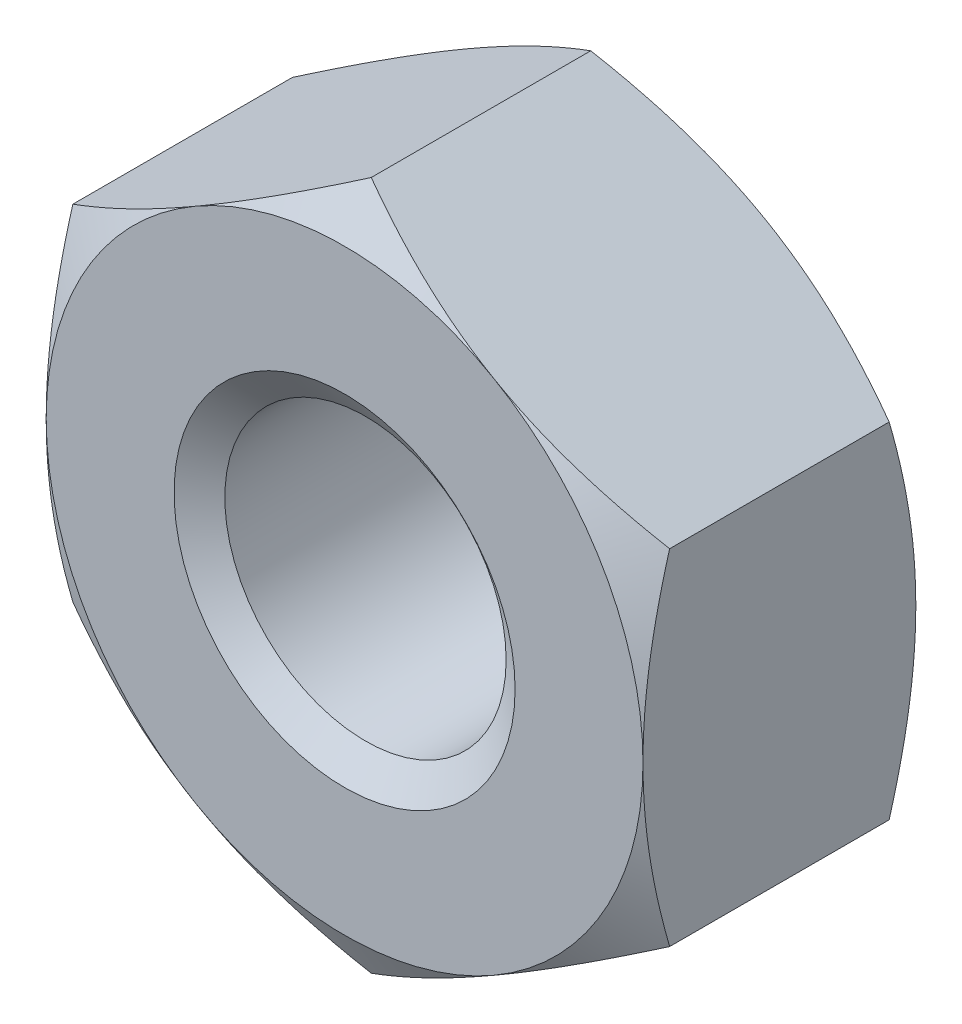
ISO-10303-21;
HEADER;
FILE_DESCRIPTION(('STEP AP214'),'2;1');
FILE_NAME('part.step','',(''),(''),'','','');
FILE_SCHEMA(('AUTOMOTIVE_DESIGN { 1 0 10303 214 1 1 1 1 }'));
ENDSEC;
DATA;
#1=APPLICATION_CONTEXT('core data for automotive mechanical design processes');
#2=APPLICATION_PROTOCOL_DEFINITION('international standard','automotive_design',2000,#1);
#3=PRODUCT_CONTEXT('',#1,'mechanical');
#4=PRODUCT('Part','Part','',(#3));
#5=PRODUCT_RELATED_PRODUCT_CATEGORY('part','',(#4));
#6=PRODUCT_DEFINITION_FORMATION('','',#4);
#7=PRODUCT_DEFINITION_CONTEXT('part definition',#1,'design');
#8=PRODUCT_DEFINITION('design','',#6,#7);
#9=PRODUCT_DEFINITION_SHAPE('','',#8);
#10=(LENGTH_UNIT() NAMED_UNIT(*) SI_UNIT(.MILLI.,.METRE.));
#11=(NAMED_UNIT(*) PLANE_ANGLE_UNIT() SI_UNIT($,.RADIAN.));
#12=(NAMED_UNIT(*) SI_UNIT($,.STERADIAN.) SOLID_ANGLE_UNIT());
#13=UNCERTAINTY_MEASURE_WITH_UNIT(LENGTH_MEASURE(1.E-05),#10,'distance_accuracy_value','');
#14=(GEOMETRIC_REPRESENTATION_CONTEXT(3) GLOBAL_UNCERTAINTY_ASSIGNED_CONTEXT((#13)) GLOBAL_UNIT_ASSIGNED_CONTEXT((#10,
#11,#12)) REPRESENTATION_CONTEXT('',''));
#15=CARTESIAN_POINT('',(0.,0.,0.));
#16=DIRECTION('',(0.,0.,1.));
#17=DIRECTION('',(1.,0.,0.));
#18=AXIS2_PLACEMENT_3D('',#15,#16,#17);
#19=CARTESIAN_POINT('',(0.,0.,-3.2));
#20=DIRECTION('',(0.,0.,1.));
#21=DIRECTION('',(1.,0.,0.));
#22=AXIS2_PLACEMENT_3D('',#19,#20,#21);
#23=CYLINDRICAL_SURFACE('',#22,1.65);
#24=CARTESIAN_POINT('',(0.,0.,-0.2450726383734));
#25=DIRECTION('',(0.,0.,1.));
#26=DIRECTION('',(1.,0.,0.));
#27=AXIS2_PLACEMENT_3D('',#24,#25,#26);
#28=CIRCLE('',#27,1.65);
#29=CARTESIAN_POINT('',(1.65,0.,-0.2450726383734));
#30=VERTEX_POINT('',#29);
#31=EDGE_CURVE('E178',#30,#30,#28,.F.);
#32=ORIENTED_EDGE('',*,*,#31,.F.);
#33=EDGE_LOOP('',(#32));
#34=FACE_BOUND('',#33,.T.);
#35=CARTESIAN_POINT('',(0.,0.,-2.9295273616266));
#36=DIRECTION('',(0.,0.,-1.));
#37=DIRECTION('',(-1.,0.,0.));
#38=AXIS2_PLACEMENT_3D('',#35,#36,#37);
#39=CIRCLE('',#38,1.65);
#40=CARTESIAN_POINT('',(-1.65,0.,-2.9295273616266));
#41=VERTEX_POINT('',#40);
#42=EDGE_CURVE('E43',#41,#41,#39,.F.);
#43=ORIENTED_EDGE('',*,*,#42,.F.);
#44=EDGE_LOOP('',(#43));
#45=FACE_BOUND('',#44,.T.);
#46=ADVANCED_FACE('F38',(#34,#45),#23,.F.);
#47=CARTESIAN_POINT('',(0.,4.04145188432739,-3.2));
#48=DIRECTION('',(-0.500000000000006,0.866025403784435,0.));
#49=DIRECTION('',(-0.866025403784435,-0.500000000000006,0.));
#50=AXIS2_PLACEMENT_3D('',#47,#48,#49);
#51=PLANE('',#50);
#52=DIRECTION('',(0.,0.,1.));
#53=VECTOR('',#52,1.);
#54=CARTESIAN_POINT('',(-3.5,2.02072594216367,-3.2));
#55=LINE('',#54,#53);
#56=CARTESIAN_POINT('',(-3.5,2.02072594216372,-2.88739260883035));
#57=VERTEX_POINT('',#56);
#58=CARTESIAN_POINT('',(-3.5,2.02072594216367,-0.312607391169638));
#59=VERTEX_POINT('',#58);
#60=EDGE_CURVE('E168',#57,#59,#55,.T.);
#61=ORIENTED_EDGE('',*,*,#60,.T.);
#62=CARTESIAN_POINT('',(-3.5002,2.02061047210983,-0.312674060693366));
#63=CARTESIAN_POINT('',(-3.34639282154755,2.10941108799265,-0.261385788989979));
#64=CARTESIAN_POINT('',(-3.19125798916558,2.19897822522907,-0.214740953816192));
#65=CARTESIAN_POINT('',(-2.87830199342322,2.37966345361543,-0.133321875533345));
#66=CARTESIAN_POINT('',(-2.72047526921251,2.47078475532381,-0.0985764355845578));
#67=CARTESIAN_POINT('',(-2.40677778961988,2.65189807961072,-0.0444900271828332));
#68=CARTESIAN_POINT('',(-2.25095530083932,2.74186223545398,-0.0247890862603791));
#69=CARTESIAN_POINT('',(-1.93857711279464,2.92221386641055,-0.00127013273725249));
#70=CARTESIAN_POINT('',(-1.78202254896578,3.01260068598,0.00256735545443638));
#71=CARTESIAN_POINT('',(-1.48949078007902,3.18149398149329,-0.00541530187697692));
#72=CARTESIAN_POINT('',(-1.3534697875421,3.26002573814992,-0.015275434069607));
#73=CARTESIAN_POINT('',(-1.08231397971101,3.41657761679354,-0.0465264668994047));
#74=CARTESIAN_POINT('',(-0.947180102315324,3.49459719728458,-0.0679280432858));
#75=CARTESIAN_POINT('',(-0.675465207594821,3.65147186489429,-0.12143040788058));
#76=CARTESIAN_POINT('',(-0.538918580721668,3.73030709667644,-0.153757994445091));
#77=CARTESIAN_POINT('',(-0.267861907055501,3.88680174018325,-0.227128933808001));
#78=CARTESIAN_POINT('',(-0.133348387531465,3.9644631568901,-0.268155046569874));
#79=CARTESIAN_POINT('',(0.00019999999999918,4.04156735438123,-0.312674060693379));
#80=B_SPLINE_CURVE_WITH_KNOTS('',3,(#62,#63,#64,#65,#66,#67,#68,#69,#70,#71,#72,#73,#74,#75,#76,
#77,#78,#79),.UNSPECIFIED.,.F.,.F.,(4,2,2,2,2,2,2,2,4),(0.,0.554793832886253,1.11092123814983,
1.65328467083218,2.19498204478403,2.6666513085086,3.13875761298268,3.62133612600511,
4.10296698719189),.UNSPECIFIED.);
#81=CARTESIAN_POINT('',(-1.75000000000002,3.03108891324552,0.));
#82=VERTEX_POINT('',#81);
#83=EDGE_CURVE('E137',#59,#82,#80,.T.);
#84=ORIENTED_EDGE('',*,*,#83,.T.);
#85=CARTESIAN_POINT('',(0.,4.04145188432739,-0.312607391169652));
#86=VERTEX_POINT('',#85);
#87=EDGE_CURVE('E57',#82,#86,#80,.T.);
#88=ORIENTED_EDGE('',*,*,#87,.T.);
#89=DIRECTION('',(0.,0.,1.));
#90=VECTOR('',#89,1.);
#91=CARTESIAN_POINT('',(0.,4.04145188432739,-3.2));
#92=LINE('',#91,#90);
#93=CARTESIAN_POINT('',(0.,4.04145188432739,-2.88739260883035));
#94=VERTEX_POINT('',#93);
#95=EDGE_CURVE('E153',#94,#86,#92,.T.);
#96=ORIENTED_EDGE('',*,*,#95,.F.);
#97=CARTESIAN_POINT('',(-3.5002,2.02061047210983,-2.88732593930664));
#98=CARTESIAN_POINT('',(-3.34639282154755,2.10941108799265,-2.93861421101002));
#99=CARTESIAN_POINT('',(-3.19125798916558,2.19897822522907,-2.98525904618381));
#100=CARTESIAN_POINT('',(-2.87830199342322,2.37966345361543,-3.06667812446666));
#101=CARTESIAN_POINT('',(-2.72047526921251,2.47078475532381,-3.10142356441544));
#102=CARTESIAN_POINT('',(-2.40677778961988,2.65189807961072,-3.15550997281717));
#103=CARTESIAN_POINT('',(-2.25095530083932,2.74186223545398,-3.17521091373962));
#104=CARTESIAN_POINT('',(-1.93857711279464,2.92221386641055,-3.19872986726275));
#105=CARTESIAN_POINT('',(-1.78202254896578,3.01260068598,-3.20256735545444));
#106=CARTESIAN_POINT('',(-1.48949078007902,3.18149398149329,-3.19458469812302));
#107=CARTESIAN_POINT('',(-1.3534697875421,3.26002573814992,-3.18472456593039));
#108=CARTESIAN_POINT('',(-1.08231397971101,3.41657761679354,-3.1534735331006));
#109=CARTESIAN_POINT('',(-0.947180102315324,3.49459719728458,-3.1320719567142));
#110=CARTESIAN_POINT('',(-0.675465207594821,3.65147186489429,-3.07856959211942));
#111=CARTESIAN_POINT('',(-0.538918580721668,3.73030709667644,-3.04624200555491));
#112=CARTESIAN_POINT('',(-0.267861907055501,3.88680174018325,-2.972871066192));
#113=CARTESIAN_POINT('',(-0.133348387531465,3.9644631568901,-2.93184495343013));
#114=CARTESIAN_POINT('',(0.000199999999999185,4.04156735438123,-2.88732593930662));
#115=B_SPLINE_CURVE_WITH_KNOTS('',3,(#97,#98,#99,#100,#101,#102,#103,#104,#105,#106,#107,#108,
#109,#110,#111,#112,#113,#114),.UNSPECIFIED.,.F.,.F.,(4,2,2,2,2,2,2,2,4),(0.,0.554793832886253,
1.11092123814983,1.65328467083218,2.19498204478403,2.6666513085086,3.13875761298268,
3.62133612600511,4.10296698719189),.UNSPECIFIED.);
#116=CARTESIAN_POINT('',(-1.75000000000002,3.03108891324552,-3.2));
#117=VERTEX_POINT('',#116);
#118=EDGE_CURVE('E171',#117,#94,#115,.T.);
#119=ORIENTED_EDGE('',*,*,#118,.F.);
#120=EDGE_CURVE('E270',#57,#117,#115,.T.);
#121=ORIENTED_EDGE('',*,*,#120,.F.);
#122=EDGE_LOOP('',(#61,#84,#88,#96,#119,#121));
#123=FACE_BOUND('',#122,.T.);
#124=ADVANCED_FACE('F40',(#123),#51,.T.);
#125=CARTESIAN_POINT('',(3.5,2.02072594216368,-3.2));
#126=DIRECTION('',(0.500000000000005,0.866025403784436,0.));
#127=DIRECTION('',(-0.866025403784436,0.500000000000005,0.));
#128=AXIS2_PLACEMENT_3D('',#125,#126,#127);
#129=PLANE('',#128);
#130=ORIENTED_EDGE('',*,*,#95,.T.);
#131=CARTESIAN_POINT('',(-0.00020000000000071,4.04156735438123,-0.31267406069338));
#132=CARTESIAN_POINT('',(0.153607178452449,3.95276673849841,-0.261385788989991));
#133=CARTESIAN_POINT('',(0.308742010834423,3.86319960126199,-0.214740953816204));
#134=CARTESIAN_POINT('',(0.62169800657678,3.68251437287563,-0.133321875533354));
#135=CARTESIAN_POINT('',(0.779524730787495,3.59139307116726,-0.0985764355845659));
#136=CARTESIAN_POINT('',(1.09322221038013,3.41027974688034,-0.0444900271828389));
#137=CARTESIAN_POINT('',(1.24904469916069,3.32031559103708,-0.0247890862603836));
#138=CARTESIAN_POINT('',(1.56142288720537,3.13996396008052,-0.00127013273725496));
#139=CARTESIAN_POINT('',(1.71797745103423,3.04957714051106,0.00256735545443491));
#140=CARTESIAN_POINT('',(2.01050921992099,2.88068384499777,-0.0054153018769763));
#141=CARTESIAN_POINT('',(2.14653021245791,2.80215208834114,-0.0152754340696052));
#142=CARTESIAN_POINT('',(2.41768602028899,2.64560020969753,-0.046526466899401));
#143=CARTESIAN_POINT('',(2.55281989768468,2.56758062920649,-0.0679280432857955));
#144=CARTESIAN_POINT('',(2.82453479240518,2.41070596159678,-0.121430407880574));
#145=CARTESIAN_POINT('',(2.96108141927833,2.33187072981462,-0.153757994445084));
#146=CARTESIAN_POINT('',(3.2321380929445,2.17537608630782,-0.22712893380799));
#147=CARTESIAN_POINT('',(3.36665161246854,2.09771466960097,-0.268155046569863));
#148=CARTESIAN_POINT('',(3.5002,2.02061047210984,-0.312674060693367));
#149=B_SPLINE_CURVE_WITH_KNOTS('',3,(#131,#132,#133,#134,#135,#136,#137,#138,#139,#140,#141,
#142,#143,#144,#145,#146,#147,#148),.UNSPECIFIED.,.F.,.F.,(4,2,2,2,2,2,2,2,4),(0.,
0.554793832886255,1.11092123814984,1.65328467083219,2.19498204478404,2.66665130850861,
3.13875761298268,3.62133612600511,4.10296698719189),.UNSPECIFIED.);
#150=CARTESIAN_POINT('',(1.75000000000002,3.03108891324552,0.));
#151=VERTEX_POINT('',#150);
#152=EDGE_CURVE('E147',#86,#151,#149,.T.);
#153=ORIENTED_EDGE('',*,*,#152,.T.);
#154=CARTESIAN_POINT('',(3.5,2.02072594216372,-0.312607391169652));
#155=VERTEX_POINT('',#154);
#156=EDGE_CURVE('E64',#151,#155,#149,.T.);
#157=ORIENTED_EDGE('',*,*,#156,.T.);
#158=DIRECTION('',(0.,0.,1.));
#159=VECTOR('',#158,1.);
#160=CARTESIAN_POINT('',(3.5,2.02072594216368,-3.2));
#161=LINE('',#160,#159);
#162=CARTESIAN_POINT('',(3.5,2.02072594216372,-2.88739260883035));
#163=VERTEX_POINT('',#162);
#164=EDGE_CURVE('E146',#163,#155,#161,.T.);
#165=ORIENTED_EDGE('',*,*,#164,.F.);
#166=CARTESIAN_POINT('',(-0.000200000000000695,4.04156735438123,-2.88732593930662));
#167=CARTESIAN_POINT('',(0.153607178452448,3.95276673849841,-2.93861421101001));
#168=CARTESIAN_POINT('',(0.308742010834423,3.86319960126199,-2.9852590461838));
#169=CARTESIAN_POINT('',(0.62169800657678,3.68251437287563,-3.06667812446665));
#170=CARTESIAN_POINT('',(0.779524730787495,3.59139307116726,-3.10142356441544));
#171=CARTESIAN_POINT('',(1.09322221038013,3.41027974688034,-3.15550997281716));
#172=CARTESIAN_POINT('',(1.24904469916069,3.32031559103708,-3.17521091373962));
#173=CARTESIAN_POINT('',(1.56142288720537,3.13996396008052,-3.19872986726275));
#174=CARTESIAN_POINT('',(1.71797745103423,3.04957714051106,-3.20256735545444));
#175=CARTESIAN_POINT('',(2.01050921992099,2.88068384499777,-3.19458469812303));
#176=CARTESIAN_POINT('',(2.14653021245791,2.80215208834114,-3.1847245659304));
#177=CARTESIAN_POINT('',(2.41768602028899,2.64560020969753,-3.1534735331006));
#178=CARTESIAN_POINT('',(2.55281989768468,2.56758062920649,-3.13207195671421));
#179=CARTESIAN_POINT('',(2.82453479240518,2.41070596159678,-3.07856959211943));
#180=CARTESIAN_POINT('',(2.96108141927834,2.33187072981462,-3.04624200555492));
#181=CARTESIAN_POINT('',(3.2321380929445,2.17537608630782,-2.97287106619201));
#182=CARTESIAN_POINT('',(3.36665161246854,2.09771466960097,-2.93184495343014));
#183=CARTESIAN_POINT('',(3.5002,2.02061047210984,-2.88732593930663));
#184=B_SPLINE_CURVE_WITH_KNOTS('',3,(#166,#167,#168,#169,#170,#171,#172,#173,#174,#175,#176,
#177,#178,#179,#180,#181,#182,#183),.UNSPECIFIED.,.F.,.F.,(4,2,2,2,2,2,2,2,4),(0.,
0.554793832886255,1.11092123814984,1.65328467083219,2.19498204478404,2.66665130850861,
3.13875761298268,3.62133612600511,4.10296698719189),.UNSPECIFIED.);
#185=CARTESIAN_POINT('',(1.75000000000002,3.03108891324552,-3.2));
#186=VERTEX_POINT('',#185);
#187=EDGE_CURVE('E263',#186,#163,#184,.T.);
#188=ORIENTED_EDGE('',*,*,#187,.F.);
#189=EDGE_CURVE('E269',#94,#186,#184,.T.);
#190=ORIENTED_EDGE('',*,*,#189,.F.);
#191=EDGE_LOOP('',(#130,#153,#157,#165,#188,#190));
#192=FACE_BOUND('',#191,.T.);
#193=ADVANCED_FACE('F144',(#192),#129,.T.);
#194=CARTESIAN_POINT('',(3.5,2.02072594216368,-3.2));
#195=DIRECTION('',(-1.,0.,0.));
#196=DIRECTION('',(0.,0.,1.));
#197=AXIS2_PLACEMENT_3D('',#194,#195,#196);
#198=PLANE('',#197);
#199=CARTESIAN_POINT('',(3.5,-5.35926299121408,-1.67484346858557));
#200=CARTESIAN_POINT('',(3.5,-5.20559319908844,-1.60058173692105));
#201=CARTESIAN_POINT('',(3.5,-5.05156008083378,-1.52705822833149));
#202=CARTESIAN_POINT('',(3.5,-4.74257074180713,-1.38190950344753));
#203=CARTESIAN_POINT('',(3.5,-4.58761436682439,-1.31028461582134));
#204=CARTESIAN_POINT('',(3.5,-4.27574500225545,-1.16897765517625));
#205=CARTESIAN_POINT('',(3.5,-4.11882589028195,-1.09930904568017));
#206=CARTESIAN_POINT('',(3.5,-3.80369792903858,-0.962964262242771));
#207=CARTESIAN_POINT('',(3.5,-3.64548914750598,-0.896287932319529));
#208=CARTESIAN_POINT('',(3.5,-3.32556618401858,-0.765931819095078));
#209=CARTESIAN_POINT('',(3.5,-3.16383281219926,-0.702298873688875));
#210=CARTESIAN_POINT('',(3.5,-2.838458409456,-0.580016702089502));
#211=CARTESIAN_POINT('',(3.5,-2.67481716858829,-0.5213680303707));
#212=CARTESIAN_POINT('',(3.5,-2.34570278472052,-0.410630279877029));
#213=CARTESIAN_POINT('',(3.5,-2.18023438248745,-0.358527255435865));
#214=CARTESIAN_POINT('',(3.5,-1.84694522806372,-0.262572936976449));
#215=CARTESIAN_POINT('',(3.5,-1.67912523787532,-0.218719033467164));
#216=CARTESIAN_POINT('',(3.5,-1.34101828610927,-0.141391945584791));
#217=CARTESIAN_POINT('',(3.5,-1.17073068027696,-0.107921525211977));
#218=CARTESIAN_POINT('',(3.5,-0.828102385138506,-0.0536149564320532));
#219=CARTESIAN_POINT('',(3.5,-0.655761694017323,-0.0327788191952388));
#220=CARTESIAN_POINT('',(3.5,-0.311020490924469,-0.00558408650575778));
#221=CARTESIAN_POINT('',(3.5,-0.138627397207279,0.000866163165910761));
#222=CARTESIAN_POINT('',(3.5,0.206038074906516,-0.0010535580779456));
#223=CARTESIAN_POINT('',(3.5,0.378310473023161,-0.00941968196343092));
#224=CARTESIAN_POINT('',(3.5,0.672490555822308,-0.0357688927868902));
#225=CARTESIAN_POINT('',(3.5,0.794722791084073,-0.050320634038419));
#226=CARTESIAN_POINT('',(3.5,1.03824305430558,-0.0859367340533525));
#227=CARTESIAN_POINT('',(3.5,1.15953093025885,-0.107002119926137));
#228=CARTESIAN_POINT('',(3.5,1.52187914771346,-0.178863187081447));
#229=CARTESIAN_POINT('',(3.5,1.7612410421263,-0.238305275622004));
#230=CARTESIAN_POINT('',(3.5,2.11940971387706,-0.340826814402547));
#231=CARTESIAN_POINT('',(3.5,2.24008344316344,-0.377749699085175));
#232=CARTESIAN_POINT('',(3.5,2.48017139213726,-0.455249007699285));
#233=CARTESIAN_POINT('',(3.5,2.5995864179561,-0.49582291166354));
#234=CARTESIAN_POINT('',(3.5,2.83665760451796,-0.579779986782742));
#235=CARTESIAN_POINT('',(3.5,2.95431988203481,-0.623146060034304));
#236=CARTESIAN_POINT('',(3.5,3.18873153508797,-0.712423559566856));
#237=CARTESIAN_POINT('',(3.5,3.30548051959461,-0.758336014592939));
#238=CARTESIAN_POINT('',(3.5,3.42180736613346,-0.805270380724059));
#239=B_SPLINE_CURVE_WITH_KNOTS('',3,(#199,#200,#201,#202,#203,#204,#205,#206,#207,#208,#209,
#210,#211,#212,#213,#214,#215,#216,#217,#218,#219,#220,#221,#222,#223,#224,#225,#226,#227,#228,
#229,#230,#231,#232,#233,#234,#235,#236,#237,#238),.UNSPECIFIED.,.F.,.F.,(4,2,2,2,2,2,2,2,2,2,2,
2,2,2,2,2,2,2,2,4),(0.,0.512025318465737,1.02413870177436,1.53918270315241,2.05419982499224,
2.57553975872798,3.09693761309353,3.61720506610401,4.13730766217538,4.65754858684365,
5.17778997146962,5.69470725122283,6.21149033452402,6.58059623222332,6.94976036239485,
7.68863804939852,8.06719621660479,8.44549507476761,8.82166461280099,9.19798724733411),.UNSPECIFIED.);
#240=CARTESIAN_POINT('',(3.5,-2.02072594216372,-0.312607391169652));
#241=VERTEX_POINT('',#240);
#242=CARTESIAN_POINT('',(3.5,0.,0.));
#243=VERTEX_POINT('',#242);
#244=EDGE_CURVE('E139',#241,#243,#239,.T.);
#245=ORIENTED_EDGE('',*,*,#244,.F.);
#246=DIRECTION('',(0.,0.,1.));
#247=VECTOR('',#246,1.);
#248=CARTESIAN_POINT('',(3.5,-2.02072594216372,-3.2));
#249=LINE('',#248,#247);
#250=CARTESIAN_POINT('',(3.5,-2.02072594216372,-2.88739260883035));
#251=VERTEX_POINT('',#250);
#252=EDGE_CURVE('E154',#251,#241,#249,.T.);
#253=ORIENTED_EDGE('',*,*,#252,.F.);
#254=CARTESIAN_POINT('',(3.5,-5.35926299121409,-1.52515653141443));
#255=CARTESIAN_POINT('',(3.5,-5.20559319908844,-1.59941826307895));
#256=CARTESIAN_POINT('',(3.5,-5.05156008083378,-1.67294177166851));
#257=CARTESIAN_POINT('',(3.5,-4.74257074180713,-1.81809049655247));
#258=CARTESIAN_POINT('',(3.5,-4.5876143668244,-1.88971538417866));
#259=CARTESIAN_POINT('',(3.5,-4.27574500225545,-2.03102234482375));
#260=CARTESIAN_POINT('',(3.5,-4.11882589028195,-2.10069095431983));
#261=CARTESIAN_POINT('',(3.5,-3.80369792903858,-2.23703573775723));
#262=CARTESIAN_POINT('',(3.5,-3.64548914750598,-2.30371206768047));
#263=CARTESIAN_POINT('',(3.5,-3.32556618401858,-2.43406818090492));
#264=CARTESIAN_POINT('',(3.5,-3.16383281219926,-2.49770112631113));
#265=CARTESIAN_POINT('',(3.5,-2.838458409456,-2.6199832979105));
#266=CARTESIAN_POINT('',(3.5,-2.67481716858829,-2.6786319696293));
#267=CARTESIAN_POINT('',(3.5,-2.34570278472052,-2.78936972012297));
#268=CARTESIAN_POINT('',(3.5,-2.18023438248745,-2.84147274456414));
#269=CARTESIAN_POINT('',(3.5,-1.84694522806372,-2.93742706302355));
#270=CARTESIAN_POINT('',(3.5,-1.67912523787532,-2.98128096653284));
#271=CARTESIAN_POINT('',(3.5,-1.34101828610927,-3.05860805441521));
#272=CARTESIAN_POINT('',(3.5,-1.17073068027696,-3.09207847478802));
#273=CARTESIAN_POINT('',(3.5,-0.828102385138505,-3.14638504356795));
#274=CARTESIAN_POINT('',(3.5,-0.655761694017323,-3.16722118080476));
#275=CARTESIAN_POINT('',(3.5,-0.31102049092447,-3.19441591349424));
#276=CARTESIAN_POINT('',(3.5,-0.13862739720728,-3.20086616316591));
#277=CARTESIAN_POINT('',(3.5,0.206038074906516,-3.19894644192206));
#278=CARTESIAN_POINT('',(3.5,0.378310473023161,-3.19058031803657));
#279=CARTESIAN_POINT('',(3.5,0.672490555822308,-3.16423110721311));
#280=CARTESIAN_POINT('',(3.5,0.794722791084072,-3.14967936596158));
#281=CARTESIAN_POINT('',(3.5,1.03824305430558,-3.11406326594665));
#282=CARTESIAN_POINT('',(3.5,1.15953093025884,-3.09299788007386));
#283=CARTESIAN_POINT('',(3.5,1.52187914771346,-3.02113681291855));
#284=CARTESIAN_POINT('',(3.5,1.7612410421263,-2.961694724378));
#285=CARTESIAN_POINT('',(3.5,2.11940971387706,-2.85917318559745));
#286=CARTESIAN_POINT('',(3.5,2.24008344316344,-2.82225030091483));
#287=CARTESIAN_POINT('',(3.5,2.48017139213726,-2.74475099230072));
#288=CARTESIAN_POINT('',(3.5,2.59958641795611,-2.70417708833646));
#289=CARTESIAN_POINT('',(3.5,2.83665760451796,-2.62022001321726));
#290=CARTESIAN_POINT('',(3.5,2.95431988203481,-2.5768539399657));
#291=CARTESIAN_POINT('',(3.5,3.18873153508797,-2.48757644043315));
#292=CARTESIAN_POINT('',(3.5,3.30548051959461,-2.44166398540706));
#293=CARTESIAN_POINT('',(3.5,3.42180736613346,-2.39472961927594));
#294=B_SPLINE_CURVE_WITH_KNOTS('',3,(#254,#255,#256,#257,#258,#259,#260,#261,#262,#263,#264,
#265,#266,#267,#268,#269,#270,#271,#272,#273,#274,#275,#276,#277,#278,#279,#280,#281,#282,#283,
#284,#285,#286,#287,#288,#289,#290,#291,#292,#293),.UNSPECIFIED.,.F.,.F.,(4,2,2,2,2,2,2,2,2,2,2,
2,2,2,2,2,2,2,2,4),(0.,0.512025318465739,1.02413870177436,1.53918270315241,2.05419982499224,
2.57553975872798,3.09693761309353,3.61720506610401,4.13730766217538,4.65754858684366,
5.17778997146962,5.69470725122283,6.21149033452402,6.58059623222332,6.94976036239486,
7.68863804939852,8.06719621660479,8.44549507476761,8.821664612801,9.19798724733411),.UNSPECIFIED.);
#295=CARTESIAN_POINT('',(3.5,0.,-3.2));
#296=VERTEX_POINT('',#295);
#297=EDGE_CURVE('E277',#251,#296,#294,.T.);
#298=ORIENTED_EDGE('',*,*,#297,.T.);
#299=EDGE_CURVE('E152',#296,#163,#294,.T.);
#300=ORIENTED_EDGE('',*,*,#299,.T.);
#301=ORIENTED_EDGE('',*,*,#164,.T.);
#302=EDGE_CURVE('E129',#243,#155,#239,.T.);
#303=ORIENTED_EDGE('',*,*,#302,.F.);
#304=EDGE_LOOP('',(#245,#253,#298,#300,#301,#303));
#305=FACE_BOUND('',#304,.T.);
#306=ADVANCED_FACE('F150',(#305),#198,.F.);
#307=CARTESIAN_POINT('',(0.,-4.04145188432744,-3.2));
#308=DIRECTION('',(0.500000000000006,-0.866025403784435,0.));
#309=DIRECTION('',(0.866025403784435,0.500000000000006,0.));
#310=AXIS2_PLACEMENT_3D('',#307,#308,#309);
#311=PLANE('',#310);
#312=ORIENTED_EDGE('',*,*,#252,.T.);
#313=CARTESIAN_POINT('',(3.5002,-2.02061047210988,-0.31267406069338));
#314=CARTESIAN_POINT('',(3.34639282154755,-2.1094110879927,-0.261385788989993));
#315=CARTESIAN_POINT('',(3.19125798916558,-2.19897822522912,-0.214740953816207));
#316=CARTESIAN_POINT('',(2.87830199342322,-2.37966345361548,-0.133321875533361));
#317=CARTESIAN_POINT('',(2.7204752692125,-2.47078475532386,-0.0985764355845747));
#318=CARTESIAN_POINT('',(2.40677778961987,-2.65189807961077,-0.0444900271828518));
#319=CARTESIAN_POINT('',(2.25095530083931,-2.74186223545403,-0.0247890862603987));
#320=CARTESIAN_POINT('',(1.93857711279462,-2.9222138664106,-0.00127013273727438));
#321=CARTESIAN_POINT('',(1.78202254896577,-3.01260068598005,0.00256735545441336));
#322=CARTESIAN_POINT('',(1.48949078007901,-3.18149398149335,-0.00541530187700179));
#323=CARTESIAN_POINT('',(1.35346978754209,-3.26002573814998,-0.0152754340696325));
#324=CARTESIAN_POINT('',(1.082313979711,-3.41657761679359,-0.0465264668994312));
#325=CARTESIAN_POINT('',(0.947180102315316,-3.49459719728463,-0.0679280432858269));
#326=CARTESIAN_POINT('',(0.675465207594816,-3.65147186489434,-0.121430407880608));
#327=CARTESIAN_POINT('',(0.538918580721665,-3.73030709667649,-0.153757994445118));
#328=CARTESIAN_POINT('',(0.267861907055499,-3.8868017401833,-0.227128933808027));
#329=CARTESIAN_POINT('',(0.133348387531464,-3.96446315689014,-0.268155046569901));
#330=CARTESIAN_POINT('',(-0.000199999999998652,-4.04156735438128,-0.312674060693406));
#331=B_SPLINE_CURVE_WITH_KNOTS('',3,(#313,#314,#315,#316,#317,#318,#319,#320,#321,#322,#323,
#324,#325,#326,#327,#328,#329,#330),.UNSPECIFIED.,.F.,.F.,(4,2,2,2,2,2,2,2,4),(0.,
0.554793832886256,1.11092123814984,1.65328467083219,2.19498204478404,2.66665130850861,
3.13875761298268,3.62133612600511,4.10296698719189),.UNSPECIFIED.);
#332=CARTESIAN_POINT('',(1.75000000000002,-3.03108891324552,0.));
#333=VERTEX_POINT('',#332);
#334=EDGE_CURVE('E375',#241,#333,#331,.T.);
#335=ORIENTED_EDGE('',*,*,#334,.T.);
#336=CARTESIAN_POINT('',(0.,-4.04145188432739,-0.312607391169652));
#337=VERTEX_POINT('',#336);
#338=EDGE_CURVE('E231',#333,#337,#331,.T.);
#339=ORIENTED_EDGE('',*,*,#338,.T.);
#340=DIRECTION('',(0.,0.,1.));
#341=VECTOR('',#340,1.);
#342=CARTESIAN_POINT('',(0.,-4.04145188432744,-3.2));
#343=LINE('',#342,#341);
#344=CARTESIAN_POINT('',(0.,-4.04145188432739,-2.88739260883035));
#345=VERTEX_POINT('',#344);
#346=EDGE_CURVE('E159',#345,#337,#343,.T.);
#347=ORIENTED_EDGE('',*,*,#346,.F.);
#348=CARTESIAN_POINT('',(3.5002,-2.02061047210988,-2.88732593930662));
#349=CARTESIAN_POINT('',(3.34639282154755,-2.1094110879927,-2.93861421101001));
#350=CARTESIAN_POINT('',(3.19125798916558,-2.19897822522912,-2.98525904618379));
#351=CARTESIAN_POINT('',(2.87830199342322,-2.37966345361548,-3.06667812446664));
#352=CARTESIAN_POINT('',(2.7204752692125,-2.47078475532386,-3.10142356441543));
#353=CARTESIAN_POINT('',(2.40677778961987,-2.65189807961077,-3.15550997281715));
#354=CARTESIAN_POINT('',(2.25095530083931,-2.74186223545403,-3.1752109137396));
#355=CARTESIAN_POINT('',(1.93857711279462,-2.9222138664106,-3.19872986726273));
#356=CARTESIAN_POINT('',(1.78202254896577,-3.01260068598005,-3.20256735545441));
#357=CARTESIAN_POINT('',(1.48949078007901,-3.18149398149335,-3.194584698123));
#358=CARTESIAN_POINT('',(1.35346978754209,-3.26002573814998,-3.18472456593037));
#359=CARTESIAN_POINT('',(1.082313979711,-3.41657761679359,-3.15347353310057));
#360=CARTESIAN_POINT('',(0.947180102315316,-3.49459719728463,-3.13207195671417));
#361=CARTESIAN_POINT('',(0.675465207594816,-3.65147186489434,-3.07856959211939));
#362=CARTESIAN_POINT('',(0.538918580721665,-3.73030709667649,-3.04624200555488));
#363=CARTESIAN_POINT('',(0.267861907055499,-3.8868017401833,-2.97287106619197));
#364=CARTESIAN_POINT('',(0.133348387531465,-3.96446315689015,-2.9318449534301));
#365=CARTESIAN_POINT('',(-0.00019999999999865,-4.04156735438128,-2.8873259393066));
#366=B_SPLINE_CURVE_WITH_KNOTS('',3,(#348,#349,#350,#351,#352,#353,#354,#355,#356,#357,#358,
#359,#360,#361,#362,#363,#364,#365),.UNSPECIFIED.,.F.,.F.,(4,2,2,2,2,2,2,2,4),(0.,
0.554793832886256,1.11092123814984,1.65328467083219,2.19498204478404,2.66665130850861,
3.13875761298268,3.62133612600511,4.10296698719189),.UNSPECIFIED.);
#367=CARTESIAN_POINT('',(1.75000000000002,-3.03108891324552,-3.2));
#368=VERTEX_POINT('',#367);
#369=EDGE_CURVE('E284',#368,#345,#366,.T.);
#370=ORIENTED_EDGE('',*,*,#369,.F.);
#371=EDGE_CURVE('E283',#251,#368,#366,.T.);
#372=ORIENTED_EDGE('',*,*,#371,.F.);
#373=EDGE_LOOP('',(#312,#335,#339,#347,#370,#372));
#374=FACE_BOUND('',#373,.T.);
#375=ADVANCED_FACE('F296',(#374),#311,.T.);
#376=CARTESIAN_POINT('',(-3.5,-2.02072594216372,-3.2));
#377=DIRECTION('',(-0.500000000000005,-0.866025403784436,0.));
#378=DIRECTION('',(0.866025403784436,-0.500000000000005,0.));
#379=AXIS2_PLACEMENT_3D('',#376,#377,#378);
#380=PLANE('',#379);
#381=ORIENTED_EDGE('',*,*,#346,.T.);
#382=CARTESIAN_POINT('',(0.000200000000001502,-4.04156735438128,-0.312674060693406));
#383=CARTESIAN_POINT('',(-0.15360717845245,-3.95276673849846,-0.261385788990017));
#384=CARTESIAN_POINT('',(-0.308742010834426,-3.86319960126203,-0.214740953816229));
#385=CARTESIAN_POINT('',(-0.621698006576787,-3.68251437287567,-0.133321875533378));
#386=CARTESIAN_POINT('',(-0.779524730787503,-3.5913930711673,-0.0985764355845897));
#387=CARTESIAN_POINT('',(-1.09322221038014,-3.41027974688038,-0.044490027182862));
#388=CARTESIAN_POINT('',(-1.2490446991607,-3.32031559103712,-0.0247890862604065));
#389=CARTESIAN_POINT('',(-1.56142288720539,-3.13996396008055,-0.00127013273727766));
#390=CARTESIAN_POINT('',(-1.71797745103425,-3.0495771405111,0.0025673554544121));
#391=CARTESIAN_POINT('',(-2.01050921992101,-2.88068384499781,-0.00541530187699943));
#392=CARTESIAN_POINT('',(-2.14653021245792,-2.80215208834118,-0.0152754340696282));
#393=CARTESIAN_POINT('',(-2.41768602028901,-2.64560020969757,-0.046526466899423));
#394=CARTESIAN_POINT('',(-2.55281989768469,-2.56758062920653,-0.0679280432858167));
#395=CARTESIAN_POINT('',(-2.82453479240519,-2.41070596159682,-0.121430407880593));
#396=CARTESIAN_POINT('',(-2.96108141927834,-2.33187072981467,-0.153757994445102));
#397=CARTESIAN_POINT('',(-3.2321380929445,-2.17537608630786,-0.227128933808006));
#398=CARTESIAN_POINT('',(-3.36665161246854,-2.09771466960102,-0.268155046569878));
#399=CARTESIAN_POINT('',(-3.5002,-2.02061047210988,-0.31267406069338));
#400=B_SPLINE_CURVE_WITH_KNOTS('',3,(#382,#383,#384,#385,#386,#387,#388,#389,#390,#391,#392,
#393,#394,#395,#396,#397,#398,#399),.UNSPECIFIED.,.F.,.F.,(4,2,2,2,2,2,2,2,4),(0.,
0.554793832886262,1.11092123814985,1.65328467083221,2.19498204478406,2.66665130850863,
3.1387576129827,3.62133612600511,4.10296698719189),.UNSPECIFIED.);
#401=CARTESIAN_POINT('',(-1.75000000000002,-3.03108891324552,0.));
#402=VERTEX_POINT('',#401);
#403=EDGE_CURVE('E372',#337,#402,#400,.T.);
#404=ORIENTED_EDGE('',*,*,#403,.T.);
#405=CARTESIAN_POINT('',(-3.5,-2.02072594216372,-0.312607391169652));
#406=VERTEX_POINT('',#405);
#407=EDGE_CURVE('E204',#402,#406,#400,.T.);
#408=ORIENTED_EDGE('',*,*,#407,.T.);
#409=DIRECTION('',(0.,0.,1.));
#410=VECTOR('',#409,1.);
#411=CARTESIAN_POINT('',(-3.5,-2.02072594216372,-3.2));
#412=LINE('',#411,#410);
#413=CARTESIAN_POINT('',(-3.5,-2.02072594216372,-2.88739260883035));
#414=VERTEX_POINT('',#413);
#415=EDGE_CURVE('E165',#414,#406,#412,.T.);
#416=ORIENTED_EDGE('',*,*,#415,.F.);
#417=CARTESIAN_POINT('',(0.000200000000001502,-4.04156735438128,-2.8873259393066));
#418=CARTESIAN_POINT('',(-0.15360717845245,-3.95276673849846,-2.93861421100998));
#419=CARTESIAN_POINT('',(-0.308742010834426,-3.86319960126203,-2.98525904618377));
#420=CARTESIAN_POINT('',(-0.621698006576787,-3.68251437287567,-3.06667812446662));
#421=CARTESIAN_POINT('',(-0.779524730787503,-3.5913930711673,-3.10142356441541));
#422=CARTESIAN_POINT('',(-1.09322221038014,-3.41027974688038,-3.15550997281714));
#423=CARTESIAN_POINT('',(-1.2490446991607,-3.32031559103712,-3.1752109137396));
#424=CARTESIAN_POINT('',(-1.56142288720539,-3.13996396008055,-3.19872986726272));
#425=CARTESIAN_POINT('',(-1.71797745103425,-3.0495771405111,-3.20256735545441));
#426=CARTESIAN_POINT('',(-2.01050921992101,-2.88068384499781,-3.194584698123));
#427=CARTESIAN_POINT('',(-2.14653021245792,-2.80215208834118,-3.18472456593037));
#428=CARTESIAN_POINT('',(-2.41768602028901,-2.64560020969757,-3.15347353310058));
#429=CARTESIAN_POINT('',(-2.55281989768469,-2.56758062920653,-3.13207195671419));
#430=CARTESIAN_POINT('',(-2.82453479240519,-2.41070596159682,-3.07856959211941));
#431=CARTESIAN_POINT('',(-2.96108141927834,-2.33187072981467,-3.0462420055549));
#432=CARTESIAN_POINT('',(-3.2321380929445,-2.17537608630786,-2.972871066192));
#433=CARTESIAN_POINT('',(-3.36665161246854,-2.09771466960102,-2.93184495343012));
#434=CARTESIAN_POINT('',(-3.5002,-2.02061047210988,-2.88732593930662));
#435=B_SPLINE_CURVE_WITH_KNOTS('',3,(#417,#418,#419,#420,#421,#422,#423,#424,#425,#426,#427,
#428,#429,#430,#431,#432,#433,#434),.UNSPECIFIED.,.F.,.F.,(4,2,2,2,2,2,2,2,4),(0.,
0.554793832886262,1.11092123814985,1.65328467083221,2.19498204478406,2.66665130850863,
3.1387576129827,3.62133612600511,4.10296698719189),.UNSPECIFIED.);
#436=CARTESIAN_POINT('',(-1.75000000000002,-3.03108891324552,-3.2));
#437=VERTEX_POINT('',#436);
#438=EDGE_CURVE('E291',#437,#414,#435,.T.);
#439=ORIENTED_EDGE('',*,*,#438,.F.);
#440=EDGE_CURVE('E290',#345,#437,#435,.T.);
#441=ORIENTED_EDGE('',*,*,#440,.F.);
#442=EDGE_LOOP('',(#381,#404,#408,#416,#439,#441));
#443=FACE_BOUND('',#442,.T.);
#444=ADVANCED_FACE('F299',(#443),#380,.T.);
#445=CARTESIAN_POINT('',(-3.5,2.02072594216367,-3.2));
#446=DIRECTION('',(-1.,0.,0.));
#447=DIRECTION('',(0.,0.,1.));
#448=AXIS2_PLACEMENT_3D('',#445,#446,#447);
#449=PLANE('',#448);
#450=ORIENTED_EDGE('',*,*,#415,.T.);
#451=CARTESIAN_POINT('',(-3.5,-5.35926299121409,-1.67484346858558));
#452=CARTESIAN_POINT('',(-3.5,-5.20559319908845,-1.60058173692105));
#453=CARTESIAN_POINT('',(-3.5,-5.05156008083379,-1.52705822833149));
#454=CARTESIAN_POINT('',(-3.5,-4.74257074180713,-1.38190950344753));
#455=CARTESIAN_POINT('',(-3.5,-4.5876143668244,-1.31028461582134));
#456=CARTESIAN_POINT('',(-3.5,-4.27574500225545,-1.16897765517625));
#457=CARTESIAN_POINT('',(-3.5,-4.11882589028195,-1.09930904568017));
#458=CARTESIAN_POINT('',(-3.5,-3.80369792903858,-0.962964262242773));
#459=CARTESIAN_POINT('',(-3.5,-3.64548914750598,-0.89628793231953));
#460=CARTESIAN_POINT('',(-3.5,-3.32556618401858,-0.765931819095078));
#461=CARTESIAN_POINT('',(-3.5,-3.16383281219926,-0.702298873688876));
#462=CARTESIAN_POINT('',(-3.5,-2.838458409456,-0.580016702089503));
#463=CARTESIAN_POINT('',(-3.5,-2.67481716858829,-0.521368030370701));
#464=CARTESIAN_POINT('',(-3.5,-2.34570278472052,-0.410630279877031));
#465=CARTESIAN_POINT('',(-3.5,-2.18023438248745,-0.358527255435866));
#466=CARTESIAN_POINT('',(-3.5,-1.84694522806372,-0.26257293697645));
#467=CARTESIAN_POINT('',(-3.5,-1.67912523787533,-0.218719033467165));
#468=CARTESIAN_POINT('',(-3.5,-1.34101828610928,-0.141391945584792));
#469=CARTESIAN_POINT('',(-3.5,-1.17073068027696,-0.107921525211977));
#470=CARTESIAN_POINT('',(-3.5,-0.828102385138511,-0.0536149564320539));
#471=CARTESIAN_POINT('',(-3.5,-0.655761694017328,-0.0327788191952394));
#472=CARTESIAN_POINT('',(-3.5,-0.311020490924474,-0.00558408650575815));
#473=CARTESIAN_POINT('',(-3.5,-0.138627397207284,0.000866163165910548));
#474=CARTESIAN_POINT('',(-3.5,0.206038074906512,-0.00105355807794538));
#475=CARTESIAN_POINT('',(-3.5,0.378310473023157,-0.00941968196343044));
#476=CARTESIAN_POINT('',(-3.5,0.672490555822304,-0.0357688927868896));
#477=CARTESIAN_POINT('',(-3.5,0.794722791084069,-0.0503206340384186));
#478=CARTESIAN_POINT('',(-3.5,1.03824305430558,-0.0859367340533519));
#479=CARTESIAN_POINT('',(-3.5,1.15953093025884,-0.107002119926137));
#480=CARTESIAN_POINT('',(-3.5,1.52187914771346,-0.178863187081446));
#481=CARTESIAN_POINT('',(-3.5,1.76124104212629,-0.238305275622003));
#482=CARTESIAN_POINT('',(-3.5,2.11940971387706,-0.340826814402545));
#483=CARTESIAN_POINT('',(-3.5,2.24008344316343,-0.377749699085174));
#484=CARTESIAN_POINT('',(-3.5,2.48017139213725,-0.455249007699283));
#485=CARTESIAN_POINT('',(-3.5,2.5995864179561,-0.495822911663538));
#486=CARTESIAN_POINT('',(-3.5,2.83665760451795,-0.57977998678274));
#487=CARTESIAN_POINT('',(-3.5,2.9543198820348,-0.623146060034302));
#488=CARTESIAN_POINT('',(-3.5,3.18873153508797,-0.712423559566853));
#489=CARTESIAN_POINT('',(-3.5,3.30548051959461,-0.758336014592936));
#490=CARTESIAN_POINT('',(-3.5,3.42180736613345,-0.805270380724056));
#491=B_SPLINE_CURVE_WITH_KNOTS('',3,(#451,#452,#453,#454,#455,#456,#457,#458,#459,#460,#461,
#462,#463,#464,#465,#466,#467,#468,#469,#470,#471,#472,#473,#474,#475,#476,#477,#478,#479,#480,
#481,#482,#483,#484,#485,#486,#487,#488,#489,#490),.UNSPECIFIED.,.F.,.F.,(4,2,2,2,2,2,2,2,2,2,2,
2,2,2,2,2,2,2,2,4),(0.,0.512025318465738,1.02413870177436,1.53918270315241,2.05419982499224,
2.57553975872799,3.09693761309354,3.61720506610401,4.13730766217538,4.65754858684366,
5.17778997146962,5.69470725122283,6.21149033452402,6.58059623222332,6.94976036239486,
7.68863804939852,8.06719621660479,8.44549507476761,8.821664612801,9.19798724733411),.UNSPECIFIED.);
#492=CARTESIAN_POINT('',(-3.5,0.,0.));
#493=VERTEX_POINT('',#492);
#494=EDGE_CURVE('E203',#406,#493,#491,.T.);
#495=ORIENTED_EDGE('',*,*,#494,.T.);
#496=EDGE_CURVE('E195',#493,#59,#491,.T.);
#497=ORIENTED_EDGE('',*,*,#496,.T.);
#498=ORIENTED_EDGE('',*,*,#60,.F.);
#499=CARTESIAN_POINT('',(-3.5,-5.35926299121409,-1.52515653141443));
#500=CARTESIAN_POINT('',(-3.5,-5.20559319908845,-1.59941826307895));
#501=CARTESIAN_POINT('',(-3.5,-5.05156008083379,-1.67294177166851));
#502=CARTESIAN_POINT('',(-3.5,-4.74257074180713,-1.81809049655247));
#503=CARTESIAN_POINT('',(-3.5,-4.5876143668244,-1.88971538417866));
#504=CARTESIAN_POINT('',(-3.5,-4.27574500225545,-2.03102234482375));
#505=CARTESIAN_POINT('',(-3.5,-4.11882589028195,-2.10069095431983));
#506=CARTESIAN_POINT('',(-3.5,-3.80369792903858,-2.23703573775723));
#507=CARTESIAN_POINT('',(-3.5,-3.64548914750598,-2.30371206768047));
#508=CARTESIAN_POINT('',(-3.5,-3.32556618401858,-2.43406818090492));
#509=CARTESIAN_POINT('',(-3.5,-3.16383281219927,-2.49770112631113));
#510=CARTESIAN_POINT('',(-3.5,-2.838458409456,-2.6199832979105));
#511=CARTESIAN_POINT('',(-3.5,-2.67481716858829,-2.6786319696293));
#512=CARTESIAN_POINT('',(-3.5,-2.34570278472052,-2.78936972012297));
#513=CARTESIAN_POINT('',(-3.5,-2.18023438248745,-2.84147274456413));
#514=CARTESIAN_POINT('',(-3.5,-1.84694522806373,-2.93742706302355));
#515=CARTESIAN_POINT('',(-3.5,-1.67912523787533,-2.98128096653284));
#516=CARTESIAN_POINT('',(-3.5,-1.34101828610928,-3.05860805441521));
#517=CARTESIAN_POINT('',(-3.5,-1.17073068027696,-3.09207847478802));
#518=CARTESIAN_POINT('',(-3.5,-0.828102385138511,-3.14638504356795));
#519=CARTESIAN_POINT('',(-3.5,-0.655761694017328,-3.16722118080476));
#520=CARTESIAN_POINT('',(-3.5,-0.311020490924475,-3.19441591349424));
#521=CARTESIAN_POINT('',(-3.5,-0.138627397207285,-3.20086616316591));
#522=CARTESIAN_POINT('',(-3.5,0.206038074906511,-3.19894644192206));
#523=CARTESIAN_POINT('',(-3.5,0.378310473023156,-3.19058031803657));
#524=CARTESIAN_POINT('',(-3.5,0.672490555822304,-3.16423110721311));
#525=CARTESIAN_POINT('',(-3.5,0.794722791084069,-3.14967936596158));
#526=CARTESIAN_POINT('',(-3.5,1.03824305430558,-3.11406326594665));
#527=CARTESIAN_POINT('',(-3.5,1.15953093025884,-3.09299788007386));
#528=CARTESIAN_POINT('',(-3.5,1.52187914771345,-3.02113681291855));
#529=CARTESIAN_POINT('',(-3.5,1.76124104212629,-2.961694724378));
#530=CARTESIAN_POINT('',(-3.5,2.11940971387705,-2.85917318559746));
#531=CARTESIAN_POINT('',(-3.5,2.24008344316343,-2.82225030091483));
#532=CARTESIAN_POINT('',(-3.5,2.48017139213725,-2.74475099230072));
#533=CARTESIAN_POINT('',(-3.5,2.5995864179561,-2.70417708833646));
#534=CARTESIAN_POINT('',(-3.5,2.83665760451795,-2.62022001321726));
#535=CARTESIAN_POINT('',(-3.5,2.9543198820348,-2.5768539399657));
#536=CARTESIAN_POINT('',(-3.5,3.18873153508796,-2.48757644043315));
#537=CARTESIAN_POINT('',(-3.5,3.3054805195946,-2.44166398540707));
#538=CARTESIAN_POINT('',(-3.5,3.42180736613345,-2.39472961927595));
#539=B_SPLINE_CURVE_WITH_KNOTS('',3,(#499,#500,#501,#502,#503,#504,#505,#506,#507,#508,#509,
#510,#511,#512,#513,#514,#515,#516,#517,#518,#519,#520,#521,#522,#523,#524,#525,#526,#527,#528,
#529,#530,#531,#532,#533,#534,#535,#536,#537,#538),.UNSPECIFIED.,.F.,.F.,(4,2,2,2,2,2,2,2,2,2,2,
2,2,2,2,2,2,2,2,4),(0.,0.512025318465738,1.02413870177436,1.53918270315241,2.05419982499224,
2.57553975872798,3.09693761309353,3.61720506610401,4.13730766217538,4.65754858684365,
5.17778997146962,5.69470725122283,6.21149033452402,6.58059623222332,6.94976036239486,
7.68863804939852,8.06719621660478,8.44549507476761,8.82166461280099,9.1979872473341),.UNSPECIFIED.);
#540=CARTESIAN_POINT('',(-3.5,0.,-3.2));
#541=VERTEX_POINT('',#540);
#542=EDGE_CURVE('E343',#541,#57,#539,.T.);
#543=ORIENTED_EDGE('',*,*,#542,.F.);
#544=EDGE_CURVE('E346',#414,#541,#539,.T.);
#545=ORIENTED_EDGE('',*,*,#544,.F.);
#546=EDGE_LOOP('',(#450,#495,#497,#498,#543,#545));
#547=FACE_BOUND('',#546,.T.);
#548=ADVANCED_FACE('F211',(#547),#449,.T.);
#549=CARTESIAN_POINT('',(0.,4.0414518843274,0.));
#550=DIRECTION('',(0.,0.,-1.));
#551=DIRECTION('',(-1.,0.,0.));
#552=AXIS2_PLACEMENT_3D('',#549,#550,#551);
#553=PLANE('',#552);
#554=CARTESIAN_POINT('',(0.,0.,0.));
#555=DIRECTION('',(0.,0.,1.));
#556=DIRECTION('',(1.,0.,0.));
#557=AXIS2_PLACEMENT_3D('',#554,#555,#556);
#558=CIRCLE('',#557,2.);
#559=CARTESIAN_POINT('',(2.,0.,0.));
#560=VERTEX_POINT('',#559);
#561=EDGE_CURVE('E180',#560,#560,#558,.T.);
#562=ORIENTED_EDGE('',*,*,#561,.F.);
#563=EDGE_LOOP('',(#562));
#564=FACE_BOUND('',#563,.T.);
#565=CARTESIAN_POINT('',(0.,0.,0.));
#566=DIRECTION('',(0.,0.,-1.));
#567=DIRECTION('',(-1.,0.,0.));
#568=AXIS2_PLACEMENT_3D('',#565,#566,#567);
#569=CIRCLE('',#568,3.5);
#570=EDGE_CURVE('E11',#493,#82,#569,.T.);
#571=ORIENTED_EDGE('',*,*,#570,.F.);
#572=EDGE_CURVE('E50',#402,#493,#569,.T.);
#573=ORIENTED_EDGE('',*,*,#572,.F.);
#574=EDGE_CURVE('E177',#333,#402,#569,.T.);
#575=ORIENTED_EDGE('',*,*,#574,.F.);
#576=EDGE_CURVE('E379',#243,#333,#569,.T.);
#577=ORIENTED_EDGE('',*,*,#576,.F.);
#578=CARTESIAN_POINT('',(0.,0.,0.));
#579=DIRECTION('',(0.,0.,1.));
#580=DIRECTION('',(1.,0.,0.));
#581=AXIS2_PLACEMENT_3D('',#578,#579,#580);
#582=CIRCLE('',#581,3.5);
#583=EDGE_CURVE('E132',#243,#151,#582,.T.);
#584=ORIENTED_EDGE('',*,*,#583,.T.);
#585=EDGE_CURVE('E48',#82,#151,#569,.T.);
#586=ORIENTED_EDGE('',*,*,#585,.F.);
#587=EDGE_LOOP('',(#571,#573,#575,#577,#584,#586));
#588=FACE_BOUND('',#587,.T.);
#589=ADVANCED_FACE('F259',(#564,#588),#553,.F.);
#590=CARTESIAN_POINT('',(0.,4.0414518843274,-3.2));
#591=DIRECTION('',(0.,0.,-1.));
#592=DIRECTION('',(-1.,0.,0.));
#593=AXIS2_PLACEMENT_3D('',#590,#591,#592);
#594=PLANE('',#593);
#595=CARTESIAN_POINT('',(0.,0.,-3.2));
#596=DIRECTION('',(0.,0.,-1.));
#597=DIRECTION('',(-1.,0.,0.));
#598=AXIS2_PLACEMENT_3D('',#595,#596,#597);
#599=CIRCLE('',#598,2.);
#600=CARTESIAN_POINT('',(-2.,0.,-3.2));
#601=VERTEX_POINT('',#600);
#602=EDGE_CURVE('E181',#601,#601,#599,.F.);
#603=ORIENTED_EDGE('',*,*,#602,.T.);
#604=EDGE_LOOP('',(#603));
#605=FACE_BOUND('',#604,.T.);
#606=CARTESIAN_POINT('',(0.,0.,-3.2));
#607=DIRECTION('',(0.,0.,-1.));
#608=DIRECTION('',(-1.,0.,0.));
#609=AXIS2_PLACEMENT_3D('',#606,#607,#608);
#610=CIRCLE('',#609,3.5);
#611=EDGE_CURVE('E174',#541,#437,#610,.F.);
#612=ORIENTED_EDGE('',*,*,#611,.F.);
#613=EDGE_CURVE('E156',#117,#541,#610,.F.);
#614=ORIENTED_EDGE('',*,*,#613,.F.);
#615=EDGE_CURVE('E173',#186,#117,#610,.F.);
#616=ORIENTED_EDGE('',*,*,#615,.F.);
#617=CARTESIAN_POINT('',(0.,0.,-3.2));
#618=DIRECTION('',(0.,0.,1.));
#619=DIRECTION('',(1.,0.,0.));
#620=AXIS2_PLACEMENT_3D('',#617,#618,#619);
#621=CIRCLE('',#620,3.5);
#622=EDGE_CURVE('E254',#296,#186,#621,.T.);
#623=ORIENTED_EDGE('',*,*,#622,.F.);
#624=EDGE_CURVE('E359',#368,#296,#610,.F.);
#625=ORIENTED_EDGE('',*,*,#624,.F.);
#626=EDGE_CURVE('E338',#437,#368,#610,.F.);
#627=ORIENTED_EDGE('',*,*,#626,.F.);
#628=EDGE_LOOP('',(#612,#614,#616,#623,#625,#627));
#629=FACE_BOUND('',#628,.T.);
#630=ADVANCED_FACE('F318',(#605,#629),#594,.T.);
#631=CARTESIAN_POINT('',(0.,0.,-3.2));
#632=DIRECTION('',(0.,0.,1.));
#633=DIRECTION('',(1.,0.,0.));
#634=AXIS2_PLACEMENT_3D('',#631,#632,#633);
#635=CONICAL_SURFACE('',#634,3.5,1.0471975511966);
#636=ORIENTED_EDGE('',*,*,#120,.T.);
#637=ORIENTED_EDGE('',*,*,#613,.T.);
#638=ORIENTED_EDGE('',*,*,#542,.T.);
#639=EDGE_LOOP('',(#636,#637,#638));
#640=FACE_BOUND('',#639,.T.);
#641=ADVANCED_FACE('F320',(#640),#635,.T.);
#642=ORIENTED_EDGE('',*,*,#118,.T.);
#643=ORIENTED_EDGE('',*,*,#189,.T.);
#644=ORIENTED_EDGE('',*,*,#615,.T.);
#645=EDGE_LOOP('',(#642,#643,#644));
#646=FACE_BOUND('',#645,.T.);
#647=ADVANCED_FACE('F325',(#646),#635,.T.);
#648=ORIENTED_EDGE('',*,*,#187,.T.);
#649=ORIENTED_EDGE('',*,*,#299,.F.);
#650=ORIENTED_EDGE('',*,*,#622,.T.);
#651=EDGE_LOOP('',(#648,#649,#650));
#652=FACE_BOUND('',#651,.T.);
#653=ADVANCED_FACE('F382',(#652),#635,.T.);
#654=ORIENTED_EDGE('',*,*,#371,.T.);
#655=ORIENTED_EDGE('',*,*,#624,.T.);
#656=ORIENTED_EDGE('',*,*,#297,.F.);
#657=EDGE_LOOP('',(#654,#655,#656));
#658=FACE_BOUND('',#657,.T.);
#659=ADVANCED_FACE('F328',(#658),#635,.T.);
#660=ORIENTED_EDGE('',*,*,#369,.T.);
#661=ORIENTED_EDGE('',*,*,#440,.T.);
#662=ORIENTED_EDGE('',*,*,#626,.T.);
#663=EDGE_LOOP('',(#660,#661,#662));
#664=FACE_BOUND('',#663,.T.);
#665=ADVANCED_FACE('F327',(#664),#635,.T.);
#666=ORIENTED_EDGE('',*,*,#438,.T.);
#667=ORIENTED_EDGE('',*,*,#544,.T.);
#668=ORIENTED_EDGE('',*,*,#611,.T.);
#669=EDGE_LOOP('',(#666,#667,#668));
#670=FACE_BOUND('',#669,.T.);
#671=ADVANCED_FACE('F219',(#670),#635,.T.);
#672=CARTESIAN_POINT('',(0.,0.,0.));
#673=DIRECTION('',(0.,0.,-1.));
#674=DIRECTION('',(-1.,0.,0.));
#675=AXIS2_PLACEMENT_3D('',#672,#673,#674);
#676=CONICAL_SURFACE('',#675,3.5,1.0471975511966);
#677=ORIENTED_EDGE('',*,*,#572,.T.);
#678=ORIENTED_EDGE('',*,*,#494,.F.);
#679=ORIENTED_EDGE('',*,*,#407,.F.);
#680=EDGE_LOOP('',(#677,#678,#679));
#681=FACE_BOUND('',#680,.T.);
#682=ADVANCED_FACE('F213',(#681),#676,.T.);
#683=ORIENTED_EDGE('',*,*,#574,.T.);
#684=ORIENTED_EDGE('',*,*,#403,.F.);
#685=ORIENTED_EDGE('',*,*,#338,.F.);
#686=EDGE_LOOP('',(#683,#684,#685));
#687=FACE_BOUND('',#686,.T.);
#688=ADVANCED_FACE('F218',(#687),#676,.T.);
#689=ORIENTED_EDGE('',*,*,#244,.T.);
#690=ORIENTED_EDGE('',*,*,#576,.T.);
#691=ORIENTED_EDGE('',*,*,#334,.F.);
#692=EDGE_LOOP('',(#689,#690,#691));
#693=FACE_BOUND('',#692,.T.);
#694=ADVANCED_FACE('F378',(#693),#676,.T.);
#695=ORIENTED_EDGE('',*,*,#583,.F.);
#696=ORIENTED_EDGE('',*,*,#302,.T.);
#697=ORIENTED_EDGE('',*,*,#156,.F.);
#698=EDGE_LOOP('',(#695,#696,#697));
#699=FACE_BOUND('',#698,.T.);
#700=ADVANCED_FACE('F130',(#699),#676,.T.);
#701=ORIENTED_EDGE('',*,*,#585,.T.);
#702=ORIENTED_EDGE('',*,*,#152,.F.);
#703=ORIENTED_EDGE('',*,*,#87,.F.);
#704=EDGE_LOOP('',(#701,#702,#703));
#705=FACE_BOUND('',#704,.T.);
#706=ADVANCED_FACE('F221',(#705),#676,.T.);
#707=ORIENTED_EDGE('',*,*,#496,.F.);
#708=ORIENTED_EDGE('',*,*,#570,.T.);
#709=ORIENTED_EDGE('',*,*,#83,.F.);
#710=EDGE_LOOP('',(#707,#708,#709));
#711=FACE_BOUND('',#710,.T.);
#712=ADVANCED_FACE('F408',(#711),#676,.T.);
#713=CARTESIAN_POINT('',(0.,0.,-0.269579902210739));
#714=DIRECTION('',(0.,0.,1.));
#715=DIRECTION('',(1.,0.,0.));
#716=AXIS2_PLACEMENT_3D('',#713,#714,#715);
#717=CONICAL_SURFACE('',#716,1.615,0.959931088596872);
#718=ORIENTED_EDGE('',*,*,#561,.T.);
#719=EDGE_LOOP('',(#718));
#720=FACE_BOUND('',#719,.T.);
#721=ORIENTED_EDGE('',*,*,#31,.T.);
#722=EDGE_LOOP('',(#721));
#723=FACE_BOUND('',#722,.T.);
#724=ADVANCED_FACE('F222',(#720,#723),#717,.F.);
#725=CARTESIAN_POINT('',(0.,0.,-3.1746));
#726=DIRECTION('',(0.,0.,-1.));
#727=DIRECTION('',(-1.,0.,0.));
#728=AXIS2_PLACEMENT_3D('',#725,#726,#727);
#729=CONICAL_SURFACE('',#728,2.,0.95993108859688);
#730=CARTESIAN_POINT('',(0.,0.,-3.1746));
#731=DIRECTION('',(0.,0.,1.));
#732=DIRECTION('',(1.,0.,0.));
#733=AXIS2_PLACEMENT_3D('',#730,#731,#732);
#734=CIRCLE('',#733,2.);
#735=CARTESIAN_POINT('',(2.,0.,-3.1746));
#736=VERTEX_POINT('',#735);
#737=EDGE_CURVE('E183',#736,#736,#734,.T.);
#738=ORIENTED_EDGE('',*,*,#737,.F.);
#739=EDGE_LOOP('',(#738));
#740=FACE_BOUND('',#739,.T.);
#741=ORIENTED_EDGE('',*,*,#42,.T.);
#742=EDGE_LOOP('',(#741));
#743=FACE_BOUND('',#742,.T.);
#744=ADVANCED_FACE('F436',(#740,#743),#729,.F.);
#745=CARTESIAN_POINT('',(0.,0.,-25.0375057290932));
#746=DIRECTION('',(0.,0.,1.));
#747=DIRECTION('',(1.,0.,0.));
#748=AXIS2_PLACEMENT_3D('',#745,#746,#747);
#749=CYLINDRICAL_SURFACE('',#748,2.);
#750=ORIENTED_EDGE('',*,*,#602,.F.);
#751=EDGE_LOOP('',(#750));
#752=FACE_BOUND('',#751,.T.);
#753=ORIENTED_EDGE('',*,*,#737,.T.);
#754=EDGE_LOOP('',(#753));
#755=FACE_BOUND('',#754,.T.);
#756=ADVANCED_FACE('F443',(#752,#755),#749,.F.);
#757=CLOSED_SHELL('',(#46,#124,#193,#306,#375,#444,#548,#589,#630,#641,#647,#653,#659,#665,#671,
#682,#688,#694,#700,#706,#712,#724,#744,#756));
#758=MANIFOLD_SOLID_BREP('B2',#757);
#759=ADVANCED_BREP_SHAPE_REPRESENTATION('',(#18,#758),#14);
#760=SHAPE_DEFINITION_REPRESENTATION(#9,#759);
ENDSEC;
END-ISO-10303-21;
